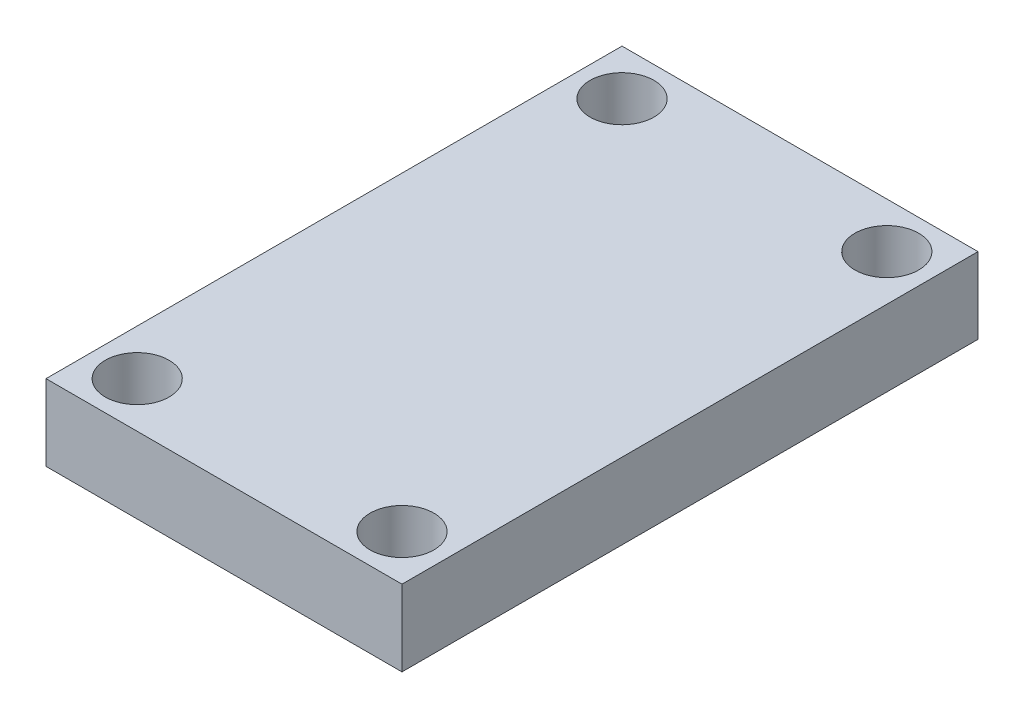
ISO-10303-21;
HEADER;
FILE_DESCRIPTION(('STEP AP214'),'2;1');
FILE_NAME('part.step','',(''),(''),'','','');
FILE_SCHEMA(('AUTOMOTIVE_DESIGN { 1 0 10303 214 1 1 1 1 }'));
ENDSEC;
DATA;
#1=APPLICATION_CONTEXT('core data for automotive mechanical design processes');
#2=APPLICATION_PROTOCOL_DEFINITION('international standard','automotive_design',2000,#1);
#3=PRODUCT_CONTEXT('',#1,'mechanical');
#4=PRODUCT('Part','Part','',(#3));
#5=PRODUCT_RELATED_PRODUCT_CATEGORY('part','',(#4));
#6=PRODUCT_DEFINITION_FORMATION('','',#4);
#7=PRODUCT_DEFINITION_CONTEXT('part definition',#1,'design');
#8=PRODUCT_DEFINITION('design','',#6,#7);
#9=PRODUCT_DEFINITION_SHAPE('','',#8);
#10=(LENGTH_UNIT() NAMED_UNIT(*) SI_UNIT(.MILLI.,.METRE.));
#11=(NAMED_UNIT(*) PLANE_ANGLE_UNIT() SI_UNIT($,.RADIAN.));
#12=(NAMED_UNIT(*) SI_UNIT($,.STERADIAN.) SOLID_ANGLE_UNIT());
#13=UNCERTAINTY_MEASURE_WITH_UNIT(LENGTH_MEASURE(1.E-05),#10,'distance_accuracy_value','');
#14=(GEOMETRIC_REPRESENTATION_CONTEXT(3) GLOBAL_UNCERTAINTY_ASSIGNED_CONTEXT((#13)) GLOBAL_UNIT_ASSIGNED_CONTEXT((#10,
#11,#12)) REPRESENTATION_CONTEXT('',''));
#15=CARTESIAN_POINT('',(0.,0.,0.));
#16=DIRECTION('',(0.,0.,1.));
#17=DIRECTION('',(1.,0.,0.));
#18=AXIS2_PLACEMENT_3D('',#15,#16,#17);
#19=CARTESIAN_POINT('',(13.4172690978936,6.35,28.7871841246453));
#20=DIRECTION('',(0.,-1.,0.));
#21=DIRECTION('',(0.,0.,-1.));
#22=AXIS2_PLACEMENT_3D('',#19,#20,#21);
#23=PLANE('',#22);
#24=CARTESIAN_POINT('',(-12.5203534846621,6.35,24.9771841246453));
#25=DIRECTION('',(0.,1.,0.));
#26=DIRECTION('',(0.,0.,-1.));
#27=AXIS2_PLACEMENT_3D('',#24,#25,#26);
#28=CIRCLE('',#27,2.667);
#29=CARTESIAN_POINT('',(-12.5203534846621,6.35,22.3101841246453));
#30=VERTEX_POINT('',#29);
#31=EDGE_CURVE('E121',#30,#30,#28,.T.);
#32=ORIENTED_EDGE('',*,*,#31,.F.);
#33=EDGE_LOOP('',(#32));
#34=FACE_BOUND('',#33,.T.);
#35=CARTESIAN_POINT('',(9.60726909789365,6.35,-15.5358158753724));
#36=DIRECTION('',(0.,1.,0.));
#37=DIRECTION('',(0.,0.,1.));
#38=AXIS2_PLACEMENT_3D('',#35,#36,#37);
#39=CIRCLE('',#38,2.667);
#40=CARTESIAN_POINT('',(9.60726909789365,6.35,-12.8688158753724));
#41=VERTEX_POINT('',#40);
#42=EDGE_CURVE('E100',#41,#41,#39,.T.);
#43=ORIENTED_EDGE('',*,*,#42,.F.);
#44=EDGE_LOOP('',(#43));
#45=FACE_BOUND('',#44,.T.);
#46=DIRECTION('',(0.,0.,-1.));
#47=VECTOR('',#46,1.);
#48=CARTESIAN_POINT('',(13.4172690978936,6.35,-19.3458158753724));
#49=LINE('',#48,#47);
#50=CARTESIAN_POINT('',(13.4172690978936,6.35,28.7871841246453));
#51=VERTEX_POINT('',#50);
#52=CARTESIAN_POINT('',(13.4172690978936,6.35,-19.3458158753724));
#53=VERTEX_POINT('',#52);
#54=EDGE_CURVE('E85',#51,#53,#49,.T.);
#55=ORIENTED_EDGE('',*,*,#54,.T.);
#56=DIRECTION('',(-1.,0.,0.));
#57=VECTOR('',#56,1.);
#58=CARTESIAN_POINT('',(13.4172690978936,6.35,-19.3458158753724));
#59=LINE('',#58,#57);
#60=CARTESIAN_POINT('',(-16.3303534846648,6.35,-19.3458158753724));
#61=VERTEX_POINT('',#60);
#62=EDGE_CURVE('E80',#53,#61,#59,.T.);
#63=ORIENTED_EDGE('',*,*,#62,.T.);
#64=DIRECTION('',(0.,0.,1.));
#65=VECTOR('',#64,1.);
#66=CARTESIAN_POINT('',(-16.3303534846648,6.35,-19.3458158753724));
#67=LINE('',#66,#65);
#68=CARTESIAN_POINT('',(-16.3303534846648,6.35,28.7871841246453));
#69=VERTEX_POINT('',#68);
#70=EDGE_CURVE('E83',#61,#69,#67,.T.);
#71=ORIENTED_EDGE('',*,*,#70,.T.);
#72=DIRECTION('',(1.,0.,0.));
#73=VECTOR('',#72,1.);
#74=CARTESIAN_POINT('',(13.4172690978936,6.35,28.7871841246453));
#75=LINE('',#74,#73);
#76=EDGE_CURVE('E50',#69,#51,#75,.T.);
#77=ORIENTED_EDGE('',*,*,#76,.T.);
#78=EDGE_LOOP('',(#55,#63,#71,#77));
#79=FACE_BOUND('',#78,.T.);
#80=CARTESIAN_POINT('',(9.60726909789365,6.35,24.9771841246453));
#81=DIRECTION('',(0.,1.,0.));
#82=DIRECTION('',(0.,0.,1.));
#83=AXIS2_PLACEMENT_3D('',#80,#81,#82);
#84=CIRCLE('',#83,2.667);
#85=CARTESIAN_POINT('',(9.60726909789365,6.35,27.6441841246453));
#86=VERTEX_POINT('',#85);
#87=EDGE_CURVE('E115',#86,#86,#84,.T.);
#88=ORIENTED_EDGE('',*,*,#87,.F.);
#89=EDGE_LOOP('',(#88));
#90=FACE_BOUND('',#89,.T.);
#91=CARTESIAN_POINT('',(-12.5203534846648,6.35,-15.5358158753724));
#92=DIRECTION('',(0.,1.,0.));
#93=DIRECTION('',(0.,0.,-1.));
#94=AXIS2_PLACEMENT_3D('',#91,#92,#93);
#95=CIRCLE('',#94,2.667);
#96=CARTESIAN_POINT('',(-12.5203534846648,6.35,-18.2028158753724));
#97=VERTEX_POINT('',#96);
#98=EDGE_CURVE('E127',#97,#97,#95,.T.);
#99=ORIENTED_EDGE('',*,*,#98,.F.);
#100=EDGE_LOOP('',(#99));
#101=FACE_BOUND('',#100,.T.);
#102=ADVANCED_FACE('F33',(#34,#45,#79,#90,#101),#23,.F.);
#103=CARTESIAN_POINT('',(13.4172690978936,0.,28.7871841246453));
#104=DIRECTION('',(0.,-1.,0.));
#105=DIRECTION('',(0.,0.,-1.));
#106=AXIS2_PLACEMENT_3D('',#103,#104,#105);
#107=PLANE('',#106);
#108=CARTESIAN_POINT('',(-12.5203534846621,0.,24.9771841246453));
#109=DIRECTION('',(0.,1.,0.));
#110=DIRECTION('',(0.,0.,-1.));
#111=AXIS2_PLACEMENT_3D('',#108,#109,#110);
#112=CIRCLE('',#111,2.667);
#113=CARTESIAN_POINT('',(-12.5203534846621,0.,22.3101841246453));
#114=VERTEX_POINT('',#113);
#115=EDGE_CURVE('E124',#114,#114,#112,.T.);
#116=ORIENTED_EDGE('',*,*,#115,.T.);
#117=EDGE_LOOP('',(#116));
#118=FACE_BOUND('',#117,.T.);
#119=CARTESIAN_POINT('',(9.60726909789365,0.,-15.5358158753724));
#120=DIRECTION('',(0.,1.,0.));
#121=DIRECTION('',(0.,0.,1.));
#122=AXIS2_PLACEMENT_3D('',#119,#120,#121);
#123=CIRCLE('',#122,2.667);
#124=CARTESIAN_POINT('',(9.60726909789365,0.,-12.8688158753724));
#125=VERTEX_POINT('',#124);
#126=EDGE_CURVE('E112',#125,#125,#123,.T.);
#127=ORIENTED_EDGE('',*,*,#126,.T.);
#128=EDGE_LOOP('',(#127));
#129=FACE_BOUND('',#128,.T.);
#130=DIRECTION('',(0.,0.,-1.));
#131=VECTOR('',#130,1.);
#132=CARTESIAN_POINT('',(13.4172690978936,0.,-19.3458158753724));
#133=LINE('',#132,#131);
#134=CARTESIAN_POINT('',(13.4172690978936,0.,28.7871841246453));
#135=VERTEX_POINT('',#134);
#136=CARTESIAN_POINT('',(13.4172690978936,0.,-19.3458158753724));
#137=VERTEX_POINT('',#136);
#138=EDGE_CURVE('E97',#135,#137,#133,.T.);
#139=ORIENTED_EDGE('',*,*,#138,.F.);
#140=DIRECTION('',(1.,0.,0.));
#141=VECTOR('',#140,1.);
#142=CARTESIAN_POINT('',(13.4172690978936,0.,28.7871841246453));
#143=LINE('',#142,#141);
#144=CARTESIAN_POINT('',(-16.3303534846648,0.,28.7871841246453));
#145=VERTEX_POINT('',#144);
#146=EDGE_CURVE('E73',#145,#135,#143,.T.);
#147=ORIENTED_EDGE('',*,*,#146,.F.);
#148=DIRECTION('',(0.,0.,1.));
#149=VECTOR('',#148,1.);
#150=CARTESIAN_POINT('',(-16.3303534846648,0.,-19.3458158753724));
#151=LINE('',#150,#149);
#152=CARTESIAN_POINT('',(-16.3303534846648,0.,-19.3458158753724));
#153=VERTEX_POINT('',#152);
#154=EDGE_CURVE('E67',#153,#145,#151,.T.);
#155=ORIENTED_EDGE('',*,*,#154,.F.);
#156=DIRECTION('',(-1.,0.,0.));
#157=VECTOR('',#156,1.);
#158=CARTESIAN_POINT('',(13.4172690978936,0.,-19.3458158753724));
#159=LINE('',#158,#157);
#160=EDGE_CURVE('E89',#137,#153,#159,.T.);
#161=ORIENTED_EDGE('',*,*,#160,.F.);
#162=EDGE_LOOP('',(#139,#147,#155,#161));
#163=FACE_BOUND('',#162,.T.);
#164=CARTESIAN_POINT('',(9.60726909789365,0.,24.9771841246453));
#165=DIRECTION('',(0.,1.,0.));
#166=DIRECTION('',(0.,0.,1.));
#167=AXIS2_PLACEMENT_3D('',#164,#165,#166);
#168=CIRCLE('',#167,2.667);
#169=CARTESIAN_POINT('',(9.60726909789365,0.,27.6441841246453));
#170=VERTEX_POINT('',#169);
#171=EDGE_CURVE('E118',#170,#170,#168,.T.);
#172=ORIENTED_EDGE('',*,*,#171,.T.);
#173=EDGE_LOOP('',(#172));
#174=FACE_BOUND('',#173,.T.);
#175=CARTESIAN_POINT('',(-12.5203534846648,0.,-15.5358158753724));
#176=DIRECTION('',(0.,1.,0.));
#177=DIRECTION('',(0.,0.,-1.));
#178=AXIS2_PLACEMENT_3D('',#175,#176,#177);
#179=CIRCLE('',#178,2.667);
#180=CARTESIAN_POINT('',(-12.5203534846648,0.,-18.2028158753724));
#181=VERTEX_POINT('',#180);
#182=EDGE_CURVE('E130',#181,#181,#179,.T.);
#183=ORIENTED_EDGE('',*,*,#182,.T.);
#184=EDGE_LOOP('',(#183));
#185=FACE_BOUND('',#184,.T.);
#186=ADVANCED_FACE('F108',(#118,#129,#163,#174,#185),#107,.T.);
#187=CARTESIAN_POINT('',(13.4172690978936,6.35,-19.3458158753724));
#188=DIRECTION('',(-1.,0.,0.));
#189=DIRECTION('',(0.,0.,1.));
#190=AXIS2_PLACEMENT_3D('',#187,#188,#189);
#191=PLANE('',#190);
#192=ORIENTED_EDGE('',*,*,#138,.T.);
#193=DIRECTION('',(0.,-1.,0.));
#194=VECTOR('',#193,1.);
#195=CARTESIAN_POINT('',(13.4172690978936,6.35,-19.3458158753724));
#196=LINE('',#195,#194);
#197=EDGE_CURVE('E11',#53,#137,#196,.T.);
#198=ORIENTED_EDGE('',*,*,#197,.F.);
#199=ORIENTED_EDGE('',*,*,#54,.F.);
#200=DIRECTION('',(0.,-1.,0.));
#201=VECTOR('',#200,1.);
#202=CARTESIAN_POINT('',(13.4172690978936,6.35,28.7871841246453));
#203=LINE('',#202,#201);
#204=EDGE_CURVE('E93',#51,#135,#203,.T.);
#205=ORIENTED_EDGE('',*,*,#204,.T.);
#206=EDGE_LOOP('',(#192,#198,#199,#205));
#207=FACE_BOUND('',#206,.T.);
#208=ADVANCED_FACE('F35',(#207),#191,.F.);
#209=CARTESIAN_POINT('',(13.4172690978936,6.35,-19.3458158753724));
#210=DIRECTION('',(0.,0.,1.));
#211=DIRECTION('',(1.,0.,0.));
#212=AXIS2_PLACEMENT_3D('',#209,#210,#211);
#213=PLANE('',#212);
#214=ORIENTED_EDGE('',*,*,#160,.T.);
#215=DIRECTION('',(0.,-1.,0.));
#216=VECTOR('',#215,1.);
#217=CARTESIAN_POINT('',(-16.3303534846648,6.35,-19.3458158753724));
#218=LINE('',#217,#216);
#219=EDGE_CURVE('E42',#61,#153,#218,.T.);
#220=ORIENTED_EDGE('',*,*,#219,.F.);
#221=ORIENTED_EDGE('',*,*,#62,.F.);
#222=ORIENTED_EDGE('',*,*,#197,.T.);
#223=EDGE_LOOP('',(#214,#220,#221,#222));
#224=FACE_BOUND('',#223,.T.);
#225=ADVANCED_FACE('F88',(#224),#213,.F.);
#226=CARTESIAN_POINT('',(-16.3303534846648,6.35,-19.3458158753724));
#227=DIRECTION('',(1.,0.,0.));
#228=DIRECTION('',(0.,0.,-1.));
#229=AXIS2_PLACEMENT_3D('',#226,#227,#228);
#230=PLANE('',#229);
#231=ORIENTED_EDGE('',*,*,#154,.T.);
#232=DIRECTION('',(0.,-1.,0.));
#233=VECTOR('',#232,1.);
#234=CARTESIAN_POINT('',(-16.3303534846648,6.35,28.7871841246453));
#235=LINE('',#234,#233);
#236=EDGE_CURVE('E90',#69,#145,#235,.T.);
#237=ORIENTED_EDGE('',*,*,#236,.F.);
#238=ORIENTED_EDGE('',*,*,#70,.F.);
#239=ORIENTED_EDGE('',*,*,#219,.T.);
#240=EDGE_LOOP('',(#231,#237,#238,#239));
#241=FACE_BOUND('',#240,.T.);
#242=ADVANCED_FACE('F91',(#241),#230,.F.);
#243=CARTESIAN_POINT('',(13.4172690978936,6.35,28.7871841246453));
#244=DIRECTION('',(0.,0.,-1.));
#245=DIRECTION('',(-1.,0.,0.));
#246=AXIS2_PLACEMENT_3D('',#243,#244,#245);
#247=PLANE('',#246);
#248=ORIENTED_EDGE('',*,*,#146,.T.);
#249=ORIENTED_EDGE('',*,*,#204,.F.);
#250=ORIENTED_EDGE('',*,*,#76,.F.);
#251=ORIENTED_EDGE('',*,*,#236,.T.);
#252=EDGE_LOOP('',(#248,#249,#250,#251));
#253=FACE_BOUND('',#252,.T.);
#254=ADVANCED_FACE('F105',(#253),#247,.F.);
#255=CARTESIAN_POINT('',(9.60726909789365,6.35,-15.5358158753724));
#256=DIRECTION('',(0.,-1.,0.));
#257=DIRECTION('',(0.,0.,-1.));
#258=AXIS2_PLACEMENT_3D('',#255,#256,#257);
#259=CYLINDRICAL_SURFACE('',#258,2.667);
#260=ORIENTED_EDGE('',*,*,#42,.T.);
#261=EDGE_LOOP('',(#260));
#262=FACE_BOUND('',#261,.T.);
#263=ORIENTED_EDGE('',*,*,#126,.F.);
#264=EDGE_LOOP('',(#263));
#265=FACE_BOUND('',#264,.T.);
#266=ADVANCED_FACE('F150',(#262,#265),#259,.F.);
#267=CARTESIAN_POINT('',(9.60726909789365,6.35,24.9771841246453));
#268=DIRECTION('',(0.,-1.,0.));
#269=DIRECTION('',(0.,0.,-1.));
#270=AXIS2_PLACEMENT_3D('',#267,#268,#269);
#271=CYLINDRICAL_SURFACE('',#270,2.667);
#272=ORIENTED_EDGE('',*,*,#87,.T.);
#273=EDGE_LOOP('',(#272));
#274=FACE_BOUND('',#273,.T.);
#275=ORIENTED_EDGE('',*,*,#171,.F.);
#276=EDGE_LOOP('',(#275));
#277=FACE_BOUND('',#276,.T.);
#278=ADVANCED_FACE('F196',(#274,#277),#271,.F.);
#279=CARTESIAN_POINT('',(-12.5203534846621,6.35,24.9771841246453));
#280=DIRECTION('',(0.,-1.,0.));
#281=DIRECTION('',(0.,0.,-1.));
#282=AXIS2_PLACEMENT_3D('',#279,#280,#281);
#283=CYLINDRICAL_SURFACE('',#282,2.667);
#284=ORIENTED_EDGE('',*,*,#31,.T.);
#285=EDGE_LOOP('',(#284));
#286=FACE_BOUND('',#285,.T.);
#287=ORIENTED_EDGE('',*,*,#115,.F.);
#288=EDGE_LOOP('',(#287));
#289=FACE_BOUND('',#288,.T.);
#290=ADVANCED_FACE('F204',(#286,#289),#283,.F.);
#291=CARTESIAN_POINT('',(-12.5203534846648,6.35,-15.5358158753724));
#292=DIRECTION('',(0.,-1.,0.));
#293=DIRECTION('',(0.,0.,-1.));
#294=AXIS2_PLACEMENT_3D('',#291,#292,#293);
#295=CYLINDRICAL_SURFACE('',#294,2.667);
#296=ORIENTED_EDGE('',*,*,#98,.T.);
#297=EDGE_LOOP('',(#296));
#298=FACE_BOUND('',#297,.T.);
#299=ORIENTED_EDGE('',*,*,#182,.F.);
#300=EDGE_LOOP('',(#299));
#301=FACE_BOUND('',#300,.T.);
#302=ADVANCED_FACE('F136',(#298,#301),#295,.F.);
#303=CLOSED_SHELL('',(#102,#186,#208,#225,#242,#254,#266,#278,#290,#302));
#304=MANIFOLD_SOLID_BREP('B2',#303);
#305=ADVANCED_BREP_SHAPE_REPRESENTATION('',(#18,#304),#14);
#306=SHAPE_DEFINITION_REPRESENTATION(#9,#305);
ENDSEC;
END-ISO-10303-21;
